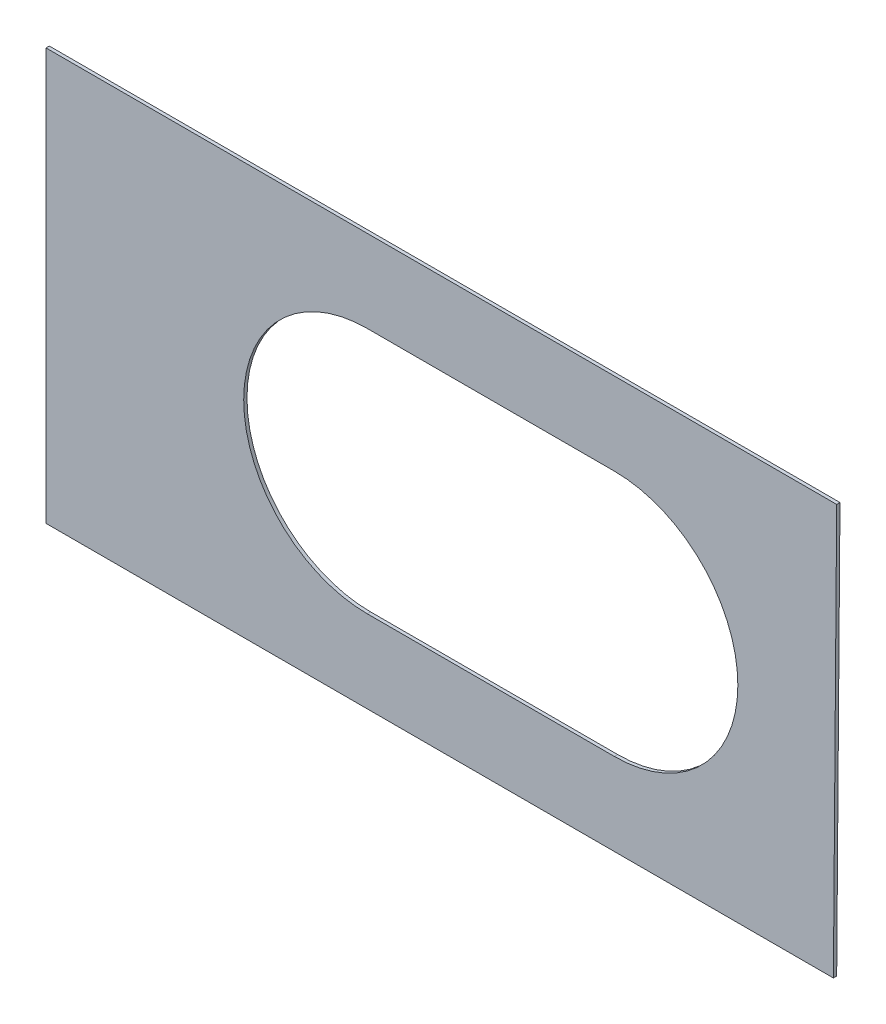
ISO-10303-21;
HEADER;
FILE_DESCRIPTION(('STEP AP214'),'2;1');
FILE_NAME('part.step','',(''),(''),'','','');
FILE_SCHEMA(('AUTOMOTIVE_DESIGN { 1 0 10303 214 1 1 1 1 }'));
ENDSEC;
DATA;
#1=APPLICATION_CONTEXT('core data for automotive mechanical design processes');
#2=APPLICATION_PROTOCOL_DEFINITION('international standard','automotive_design',2000,#1);
#3=PRODUCT_CONTEXT('',#1,'mechanical');
#4=PRODUCT('Part','Part','',(#3));
#5=PRODUCT_RELATED_PRODUCT_CATEGORY('part','',(#4));
#6=PRODUCT_DEFINITION_FORMATION('','',#4);
#7=PRODUCT_DEFINITION_CONTEXT('part definition',#1,'design');
#8=PRODUCT_DEFINITION('design','',#6,#7);
#9=PRODUCT_DEFINITION_SHAPE('','',#8);
#10=(LENGTH_UNIT() NAMED_UNIT(*) SI_UNIT(.MILLI.,.METRE.));
#11=(NAMED_UNIT(*) PLANE_ANGLE_UNIT() SI_UNIT($,.RADIAN.));
#12=(NAMED_UNIT(*) SI_UNIT($,.STERADIAN.) SOLID_ANGLE_UNIT());
#13=UNCERTAINTY_MEASURE_WITH_UNIT(LENGTH_MEASURE(1.E-05),#10,'distance_accuracy_value','');
#14=(GEOMETRIC_REPRESENTATION_CONTEXT(3) GLOBAL_UNCERTAINTY_ASSIGNED_CONTEXT((#13)) GLOBAL_UNIT_ASSIGNED_CONTEXT((#10,
#11,#12)) REPRESENTATION_CONTEXT('',''));
#15=CARTESIAN_POINT('',(0.,0.,0.));
#16=DIRECTION('',(0.,0.,1.));
#17=DIRECTION('',(1.,0.,0.));
#18=AXIS2_PLACEMENT_3D('',#15,#16,#17);
#19=CARTESIAN_POINT('',(0.,0.,2.));
#20=DIRECTION('',(0.,0.,1.));
#21=DIRECTION('',(1.,0.,0.));
#22=AXIS2_PLACEMENT_3D('',#19,#20,#21);
#23=PLANE('',#22);
#24=DIRECTION('',(0.,-1.,0.));
#25=VECTOR('',#24,1.);
#26=CARTESIAN_POINT('',(-240.,125.,2.));
#27=LINE('',#26,#25);
#28=CARTESIAN_POINT('',(-240.,125.,2.));
#29=VERTEX_POINT('',#28);
#30=CARTESIAN_POINT('',(-240.,-125.,2.));
#31=VERTEX_POINT('',#30);
#32=EDGE_CURVE('E153',#29,#31,#27,.T.);
#33=ORIENTED_EDGE('',*,*,#32,.T.);
#34=DIRECTION('',(1.,0.,0.));
#35=VECTOR('',#34,1.);
#36=CARTESIAN_POINT('',(-240.,-125.,2.));
#37=LINE('',#36,#35);
#38=CARTESIAN_POINT('',(238.,-125.,2.));
#39=VERTEX_POINT('',#38);
#40=EDGE_CURVE('E157',#31,#39,#37,.T.);
#41=ORIENTED_EDGE('',*,*,#40,.T.);
#42=DIRECTION('',(0.00799974401228724,0.999968001535918,0.));
#43=VECTOR('',#42,1.);
#44=CARTESIAN_POINT('',(240.,125.,2.));
#45=LINE('',#44,#43);
#46=CARTESIAN_POINT('',(240.,125.,2.));
#47=VERTEX_POINT('',#46);
#48=EDGE_CURVE('E161',#39,#47,#45,.T.);
#49=ORIENTED_EDGE('',*,*,#48,.T.);
#50=DIRECTION('',(-1.,0.,0.));
#51=VECTOR('',#50,1.);
#52=CARTESIAN_POINT('',(-240.,125.,2.));
#53=LINE('',#52,#51);
#54=EDGE_CURVE('E164',#47,#29,#53,.T.);
#55=ORIENTED_EDGE('',*,*,#54,.T.);
#56=EDGE_LOOP('',(#33,#41,#49,#55));
#57=FACE_BOUND('',#56,.T.);
#58=DIRECTION('',(1.,0.,0.));
#59=VECTOR('',#58,1.);
#60=CARTESIAN_POINT('',(-45.,-75.,2.));
#61=LINE('',#60,#59);
#62=CARTESIAN_POINT('',(-45.,-75.,2.));
#63=VERTEX_POINT('',#62);
#64=CARTESIAN_POINT('',(105.,-75.,2.));
#65=VERTEX_POINT('',#64);
#66=EDGE_CURVE('E114',#63,#65,#61,.T.);
#67=ORIENTED_EDGE('',*,*,#66,.F.);
#68=CARTESIAN_POINT('',(-45.,0.,2.));
#69=DIRECTION('',(0.,0.,1.));
#70=DIRECTION('',(1.,0.,0.));
#71=AXIS2_PLACEMENT_3D('',#68,#69,#70);
#72=CIRCLE('',#71,75.);
#73=CARTESIAN_POINT('',(-45.,75.,2.));
#74=VERTEX_POINT('',#73);
#75=EDGE_CURVE('E105',#74,#63,#72,.T.);
#76=ORIENTED_EDGE('',*,*,#75,.F.);
#77=DIRECTION('',(-1.,0.,0.));
#78=VECTOR('',#77,1.);
#79=CARTESIAN_POINT('',(-45.,75.,2.));
#80=LINE('',#79,#78);
#81=CARTESIAN_POINT('',(105.,75.,2.));
#82=VERTEX_POINT('',#81);
#83=EDGE_CURVE('E131',#82,#74,#80,.T.);
#84=ORIENTED_EDGE('',*,*,#83,.F.);
#85=CARTESIAN_POINT('',(105.,0.,2.));
#86=DIRECTION('',(0.,0.,1.));
#87=DIRECTION('',(1.,0.,0.));
#88=AXIS2_PLACEMENT_3D('',#85,#86,#87);
#89=CIRCLE('',#88,75.);
#90=EDGE_CURVE('E127',#65,#82,#89,.T.);
#91=ORIENTED_EDGE('',*,*,#90,.F.);
#92=EDGE_LOOP('',(#67,#76,#84,#91));
#93=FACE_BOUND('',#92,.T.);
#94=ADVANCED_FACE('F39',(#57,#93),#23,.T.);
#95=CARTESIAN_POINT('',(0.,0.,0.));
#96=DIRECTION('',(0.,0.,1.));
#97=DIRECTION('',(1.,0.,0.));
#98=AXIS2_PLACEMENT_3D('',#95,#96,#97);
#99=PLANE('',#98);
#100=DIRECTION('',(0.,-1.,0.));
#101=VECTOR('',#100,1.);
#102=CARTESIAN_POINT('',(-240.,125.,0.));
#103=LINE('',#102,#101);
#104=CARTESIAN_POINT('',(-240.,125.,0.));
#105=VERTEX_POINT('',#104);
#106=CARTESIAN_POINT('',(-240.,-125.,0.));
#107=VERTEX_POINT('',#106);
#108=EDGE_CURVE('E123',#105,#107,#103,.T.);
#109=ORIENTED_EDGE('',*,*,#108,.F.);
#110=DIRECTION('',(-1.,0.,0.));
#111=VECTOR('',#110,1.);
#112=CARTESIAN_POINT('',(-240.,125.,0.));
#113=LINE('',#112,#111);
#114=CARTESIAN_POINT('',(240.,125.,0.));
#115=VERTEX_POINT('',#114);
#116=EDGE_CURVE('E158',#115,#105,#113,.T.);
#117=ORIENTED_EDGE('',*,*,#116,.F.);
#118=DIRECTION('',(0.00799974401228724,0.999968001535918,0.));
#119=VECTOR('',#118,1.);
#120=CARTESIAN_POINT('',(240.,125.,0.));
#121=LINE('',#120,#119);
#122=CARTESIAN_POINT('',(238.,-125.,0.));
#123=VERTEX_POINT('',#122);
#124=EDGE_CURVE('E174',#123,#115,#121,.T.);
#125=ORIENTED_EDGE('',*,*,#124,.F.);
#126=DIRECTION('',(1.,0.,0.));
#127=VECTOR('',#126,1.);
#128=CARTESIAN_POINT('',(-240.,-125.,0.));
#129=LINE('',#128,#127);
#130=EDGE_CURVE('E171',#107,#123,#129,.T.);
#131=ORIENTED_EDGE('',*,*,#130,.F.);
#132=EDGE_LOOP('',(#109,#117,#125,#131));
#133=FACE_BOUND('',#132,.T.);
#134=CARTESIAN_POINT('',(-45.,0.,0.));
#135=DIRECTION('',(0.,0.,1.));
#136=DIRECTION('',(1.,0.,0.));
#137=AXIS2_PLACEMENT_3D('',#134,#135,#136);
#138=CIRCLE('',#137,75.);
#139=CARTESIAN_POINT('',(-45.,75.,0.));
#140=VERTEX_POINT('',#139);
#141=CARTESIAN_POINT('',(-45.,-75.,0.));
#142=VERTEX_POINT('',#141);
#143=EDGE_CURVE('E63',#140,#142,#138,.T.);
#144=ORIENTED_EDGE('',*,*,#143,.T.);
#145=DIRECTION('',(1.,0.,0.));
#146=VECTOR('',#145,1.);
#147=CARTESIAN_POINT('',(-45.,-75.,0.));
#148=LINE('',#147,#146);
#149=CARTESIAN_POINT('',(105.,-75.,0.));
#150=VERTEX_POINT('',#149);
#151=EDGE_CURVE('E121',#142,#150,#148,.T.);
#152=ORIENTED_EDGE('',*,*,#151,.T.);
#153=CARTESIAN_POINT('',(105.,0.,0.));
#154=DIRECTION('',(0.,0.,1.));
#155=DIRECTION('',(1.,0.,0.));
#156=AXIS2_PLACEMENT_3D('',#153,#154,#155);
#157=CIRCLE('',#156,75.);
#158=CARTESIAN_POINT('',(105.,75.,0.));
#159=VERTEX_POINT('',#158);
#160=EDGE_CURVE('E140',#150,#159,#157,.T.);
#161=ORIENTED_EDGE('',*,*,#160,.T.);
#162=DIRECTION('',(-1.,0.,0.));
#163=VECTOR('',#162,1.);
#164=CARTESIAN_POINT('',(-45.,75.,0.));
#165=LINE('',#164,#163);
#166=EDGE_CURVE('E115',#159,#140,#165,.T.);
#167=ORIENTED_EDGE('',*,*,#166,.T.);
#168=EDGE_LOOP('',(#144,#152,#161,#167));
#169=FACE_BOUND('',#168,.T.);
#170=ADVANCED_FACE('F197',(#133,#169),#99,.F.);
#171=CARTESIAN_POINT('',(-240.,125.,2.));
#172=DIRECTION('',(1.,0.,0.));
#173=DIRECTION('',(0.,0.,-1.));
#174=AXIS2_PLACEMENT_3D('',#171,#172,#173);
#175=PLANE('',#174);
#176=ORIENTED_EDGE('',*,*,#108,.T.);
#177=DIRECTION('',(0.,0.,-1.));
#178=VECTOR('',#177,1.);
#179=CARTESIAN_POINT('',(-240.,-125.,2.));
#180=LINE('',#179,#178);
#181=EDGE_CURVE('E11',#31,#107,#180,.T.);
#182=ORIENTED_EDGE('',*,*,#181,.F.);
#183=ORIENTED_EDGE('',*,*,#32,.F.);
#184=DIRECTION('',(0.,0.,-1.));
#185=VECTOR('',#184,1.);
#186=CARTESIAN_POINT('',(-240.,125.,2.));
#187=LINE('',#186,#185);
#188=EDGE_CURVE('E167',#29,#105,#187,.T.);
#189=ORIENTED_EDGE('',*,*,#188,.T.);
#190=EDGE_LOOP('',(#176,#182,#183,#189));
#191=FACE_BOUND('',#190,.T.);
#192=ADVANCED_FACE('F41',(#191),#175,.F.);
#193=CARTESIAN_POINT('',(-240.,-125.,2.));
#194=DIRECTION('',(0.,1.,0.));
#195=DIRECTION('',(-1.,0.,0.));
#196=AXIS2_PLACEMENT_3D('',#193,#194,#195);
#197=PLANE('',#196);
#198=ORIENTED_EDGE('',*,*,#130,.T.);
#199=DIRECTION('',(0.,0.,-1.));
#200=VECTOR('',#199,1.);
#201=CARTESIAN_POINT('',(238.,-125.,2.));
#202=LINE('',#201,#200);
#203=EDGE_CURVE('E48',#39,#123,#202,.T.);
#204=ORIENTED_EDGE('',*,*,#203,.F.);
#205=ORIENTED_EDGE('',*,*,#40,.F.);
#206=ORIENTED_EDGE('',*,*,#181,.T.);
#207=EDGE_LOOP('',(#198,#204,#205,#206));
#208=FACE_BOUND('',#207,.T.);
#209=ADVANCED_FACE('F207',(#208),#197,.F.);
#210=CARTESIAN_POINT('',(240.,125.,2.));
#211=DIRECTION('',(-0.999968001535918,0.00799974401228724,0.));
#212=DIRECTION('',(-0.00799974401228724,-0.999968001535918,0.));
#213=AXIS2_PLACEMENT_3D('',#210,#211,#212);
#214=PLANE('',#213);
#215=ORIENTED_EDGE('',*,*,#124,.T.);
#216=DIRECTION('',(0.,0.,-1.));
#217=VECTOR('',#216,1.);
#218=CARTESIAN_POINT('',(240.,125.,2.));
#219=LINE('',#218,#217);
#220=EDGE_CURVE('E182',#47,#115,#219,.T.);
#221=ORIENTED_EDGE('',*,*,#220,.F.);
#222=ORIENTED_EDGE('',*,*,#48,.F.);
#223=ORIENTED_EDGE('',*,*,#203,.T.);
#224=EDGE_LOOP('',(#215,#221,#222,#223));
#225=FACE_BOUND('',#224,.T.);
#226=ADVANCED_FACE('F191',(#225),#214,.F.);
#227=CARTESIAN_POINT('',(-240.,125.,2.));
#228=DIRECTION('',(0.,-1.,0.));
#229=DIRECTION('',(0.,0.,-1.));
#230=AXIS2_PLACEMENT_3D('',#227,#228,#229);
#231=PLANE('',#230);
#232=ORIENTED_EDGE('',*,*,#116,.T.);
#233=ORIENTED_EDGE('',*,*,#188,.F.);
#234=ORIENTED_EDGE('',*,*,#54,.F.);
#235=ORIENTED_EDGE('',*,*,#220,.T.);
#236=EDGE_LOOP('',(#232,#233,#234,#235));
#237=FACE_BOUND('',#236,.T.);
#238=ADVANCED_FACE('F201',(#237),#231,.F.);
#239=CARTESIAN_POINT('',(-45.,0.,2.));
#240=DIRECTION('',(0.,0.,-1.));
#241=DIRECTION('',(-1.,0.,0.));
#242=AXIS2_PLACEMENT_3D('',#239,#240,#241);
#243=CYLINDRICAL_SURFACE('',#242,75.);
#244=ORIENTED_EDGE('',*,*,#143,.F.);
#245=DIRECTION('',(0.,0.,-1.));
#246=VECTOR('',#245,1.);
#247=CARTESIAN_POINT('',(-45.,75.,2.));
#248=LINE('',#247,#246);
#249=EDGE_CURVE('E109',#74,#140,#248,.T.);
#250=ORIENTED_EDGE('',*,*,#249,.F.);
#251=ORIENTED_EDGE('',*,*,#75,.T.);
#252=DIRECTION('',(0.,0.,-1.));
#253=VECTOR('',#252,1.);
#254=CARTESIAN_POINT('',(-45.,-75.,2.));
#255=LINE('',#254,#253);
#256=EDGE_CURVE('E108',#63,#142,#255,.T.);
#257=ORIENTED_EDGE('',*,*,#256,.T.);
#258=EDGE_LOOP('',(#244,#250,#251,#257));
#259=FACE_BOUND('',#258,.T.);
#260=ADVANCED_FACE('F107',(#259),#243,.F.);
#261=CARTESIAN_POINT('',(-45.,-75.,2.));
#262=DIRECTION('',(0.,1.,0.));
#263=DIRECTION('',(0.,0.,1.));
#264=AXIS2_PLACEMENT_3D('',#261,#262,#263);
#265=PLANE('',#264);
#266=ORIENTED_EDGE('',*,*,#151,.F.);
#267=ORIENTED_EDGE('',*,*,#256,.F.);
#268=ORIENTED_EDGE('',*,*,#66,.T.);
#269=DIRECTION('',(0.,0.,-1.));
#270=VECTOR('',#269,1.);
#271=CARTESIAN_POINT('',(105.,-75.,2.));
#272=LINE('',#271,#270);
#273=EDGE_CURVE('E124',#65,#150,#272,.T.);
#274=ORIENTED_EDGE('',*,*,#273,.T.);
#275=EDGE_LOOP('',(#266,#267,#268,#274));
#276=FACE_BOUND('',#275,.T.);
#277=ADVANCED_FACE('F118',(#276),#265,.T.);
#278=CARTESIAN_POINT('',(105.,0.,2.));
#279=DIRECTION('',(0.,0.,-1.));
#280=DIRECTION('',(-1.,0.,0.));
#281=AXIS2_PLACEMENT_3D('',#278,#279,#280);
#282=CYLINDRICAL_SURFACE('',#281,75.);
#283=ORIENTED_EDGE('',*,*,#160,.F.);
#284=ORIENTED_EDGE('',*,*,#273,.F.);
#285=ORIENTED_EDGE('',*,*,#90,.T.);
#286=DIRECTION('',(0.,0.,-1.));
#287=VECTOR('',#286,1.);
#288=CARTESIAN_POINT('',(105.,75.,2.));
#289=LINE('',#288,#287);
#290=EDGE_CURVE('E55',#82,#159,#289,.T.);
#291=ORIENTED_EDGE('',*,*,#290,.T.);
#292=EDGE_LOOP('',(#283,#284,#285,#291));
#293=FACE_BOUND('',#292,.T.);
#294=ADVANCED_FACE('F230',(#293),#282,.F.);
#295=CARTESIAN_POINT('',(-45.,75.,2.));
#296=DIRECTION('',(0.,-1.,0.));
#297=DIRECTION('',(0.,0.,-1.));
#298=AXIS2_PLACEMENT_3D('',#295,#296,#297);
#299=PLANE('',#298);
#300=ORIENTED_EDGE('',*,*,#166,.F.);
#301=ORIENTED_EDGE('',*,*,#290,.F.);
#302=ORIENTED_EDGE('',*,*,#83,.T.);
#303=ORIENTED_EDGE('',*,*,#249,.T.);
#304=EDGE_LOOP('',(#300,#301,#302,#303));
#305=FACE_BOUND('',#304,.T.);
#306=ADVANCED_FACE('F234',(#305),#299,.T.);
#307=CLOSED_SHELL('',(#94,#170,#192,#209,#226,#238,#260,#277,#294,#306));
#308=MANIFOLD_SOLID_BREP('B2',#307);
#309=ADVANCED_BREP_SHAPE_REPRESENTATION('',(#18,#308),#14);
#310=SHAPE_DEFINITION_REPRESENTATION(#9,#309);
ENDSEC;
END-ISO-10303-21;
